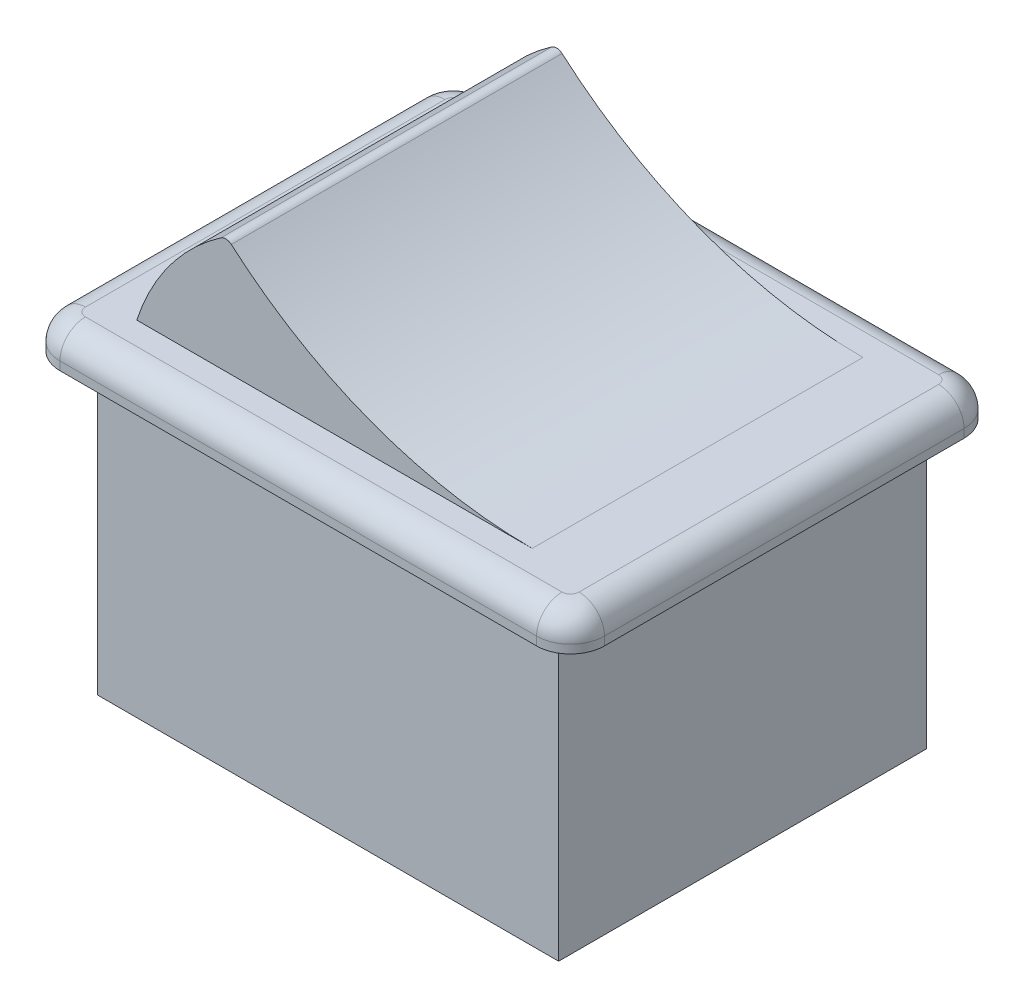
ISO-10303-21;
HEADER;
FILE_DESCRIPTION(('STEP AP214'),'2;1');
FILE_NAME('part.step','',(''),(''),'','','');
FILE_SCHEMA(('AUTOMOTIVE_DESIGN { 1 0 10303 214 1 1 1 1 }'));
ENDSEC;
DATA;
#1=APPLICATION_CONTEXT('core data for automotive mechanical design processes');
#2=APPLICATION_PROTOCOL_DEFINITION('international standard','automotive_design',2000,#1);
#3=PRODUCT_CONTEXT('',#1,'mechanical');
#4=PRODUCT('Part','Part','',(#3));
#5=PRODUCT_RELATED_PRODUCT_CATEGORY('part','',(#4));
#6=PRODUCT_DEFINITION_FORMATION('','',#4);
#7=PRODUCT_DEFINITION_CONTEXT('part definition',#1,'design');
#8=PRODUCT_DEFINITION('design','',#6,#7);
#9=PRODUCT_DEFINITION_SHAPE('','',#8);
#10=(LENGTH_UNIT() NAMED_UNIT(*) SI_UNIT(.MILLI.,.METRE.));
#11=(NAMED_UNIT(*) PLANE_ANGLE_UNIT() SI_UNIT($,.RADIAN.));
#12=(NAMED_UNIT(*) SI_UNIT($,.STERADIAN.) SOLID_ANGLE_UNIT());
#13=UNCERTAINTY_MEASURE_WITH_UNIT(LENGTH_MEASURE(1.E-05),#10,'distance_accuracy_value','');
#14=(GEOMETRIC_REPRESENTATION_CONTEXT(3) GLOBAL_UNCERTAINTY_ASSIGNED_CONTEXT((#13)) GLOBAL_UNIT_ASSIGNED_CONTEXT((#10,
#11,#12)) REPRESENTATION_CONTEXT('',''));
#15=CARTESIAN_POINT('',(0.,0.,0.));
#16=DIRECTION('',(0.,0.,1.));
#17=DIRECTION('',(1.,0.,0.));
#18=AXIS2_PLACEMENT_3D('',#15,#16,#17);
#19=CARTESIAN_POINT('',(14.05,2.,-10.6));
#20=DIRECTION('',(0.,-1.,0.));
#21=DIRECTION('',(0.,0.,-1.));
#22=AXIS2_PLACEMENT_3D('',#19,#20,#21);
#23=CYLINDRICAL_SURFACE('',#22,2.);
#24=DIRECTION('',(0.,-1.,0.));
#25=VECTOR('',#24,1.);
#26=CARTESIAN_POINT('',(14.05,2.,-12.6));
#27=LINE('',#26,#25);
#28=CARTESIAN_POINT('',(14.05,0.5,-12.6));
#29=VERTEX_POINT('',#28);
#30=CARTESIAN_POINT('',(14.05,0.,-12.6));
#31=VERTEX_POINT('',#30);
#32=EDGE_CURVE('E264',#29,#31,#27,.T.);
#33=ORIENTED_EDGE('',*,*,#32,.F.);
#34=CARTESIAN_POINT('',(14.05,0.5,-10.6));
#35=DIRECTION('',(0.,-1.,0.));
#36=DIRECTION('',(0.,0.,-1.));
#37=AXIS2_PLACEMENT_3D('',#34,#35,#36);
#38=CIRCLE('',#37,2.);
#39=CARTESIAN_POINT('',(16.05,0.5,-10.6));
#40=VERTEX_POINT('',#39);
#41=EDGE_CURVE('E11',#29,#40,#38,.T.);
#42=ORIENTED_EDGE('',*,*,#41,.T.);
#43=DIRECTION('',(0.,-1.,0.));
#44=VECTOR('',#43,1.);
#45=CARTESIAN_POINT('',(16.05,2.,-10.6));
#46=LINE('',#45,#44);
#47=CARTESIAN_POINT('',(16.05,0.,-10.6));
#48=VERTEX_POINT('',#47);
#49=EDGE_CURVE('E250',#40,#48,#46,.T.);
#50=ORIENTED_EDGE('',*,*,#49,.T.);
#51=CARTESIAN_POINT('',(14.05,0.,-10.6));
#52=DIRECTION('',(0.,1.,0.));
#53=DIRECTION('',(0.,0.,-1.));
#54=AXIS2_PLACEMENT_3D('',#51,#52,#53);
#55=CIRCLE('',#54,2.);
#56=EDGE_CURVE('E226',#48,#31,#55,.T.);
#57=ORIENTED_EDGE('',*,*,#56,.T.);
#58=EDGE_LOOP('',(#33,#42,#50,#57));
#59=FACE_BOUND('',#58,.T.);
#60=ADVANCED_FACE('F33',(#59),#23,.T.);
#61=CARTESIAN_POINT('',(-14.05,2.,-12.6));
#62=DIRECTION('',(0.,0.,1.));
#63=DIRECTION('',(1.,0.,0.));
#64=AXIS2_PLACEMENT_3D('',#61,#62,#63);
#65=PLANE('',#64);
#66=DIRECTION('',(0.,-1.,0.));
#67=VECTOR('',#66,1.);
#68=CARTESIAN_POINT('',(-14.05,2.,-12.6));
#69=LINE('',#68,#67);
#70=CARTESIAN_POINT('',(-14.05,0.5,-12.6));
#71=VERTEX_POINT('',#70);
#72=CARTESIAN_POINT('',(-14.05,0.,-12.6));
#73=VERTEX_POINT('',#72);
#74=EDGE_CURVE('E262',#71,#73,#69,.T.);
#75=ORIENTED_EDGE('',*,*,#74,.F.);
#76=DIRECTION('',(-1.,0.,0.));
#77=VECTOR('',#76,1.);
#78=CARTESIAN_POINT('',(-14.05,0.5,-12.6));
#79=LINE('',#78,#77);
#80=EDGE_CURVE('E42',#71,#29,#79,.F.);
#81=ORIENTED_EDGE('',*,*,#80,.T.);
#82=ORIENTED_EDGE('',*,*,#32,.T.);
#83=DIRECTION('',(-1.,0.,0.));
#84=VECTOR('',#83,1.);
#85=CARTESIAN_POINT('',(-14.05,0.,-12.6));
#86=LINE('',#85,#84);
#87=EDGE_CURVE('E229',#31,#73,#86,.T.);
#88=ORIENTED_EDGE('',*,*,#87,.T.);
#89=EDGE_LOOP('',(#75,#81,#82,#88));
#90=FACE_BOUND('',#89,.T.);
#91=ADVANCED_FACE('F372',(#90),#65,.F.);
#92=CARTESIAN_POINT('',(-14.05,2.,-10.6));
#93=DIRECTION('',(0.,-1.,0.));
#94=DIRECTION('',(0.,0.,-1.));
#95=AXIS2_PLACEMENT_3D('',#92,#93,#94);
#96=CYLINDRICAL_SURFACE('',#95,2.);
#97=DIRECTION('',(0.,-1.,0.));
#98=VECTOR('',#97,1.);
#99=CARTESIAN_POINT('',(-16.05,2.,-10.6));
#100=LINE('',#99,#98);
#101=CARTESIAN_POINT('',(-16.05,0.5,-10.6));
#102=VERTEX_POINT('',#101);
#103=CARTESIAN_POINT('',(-16.05,0.,-10.6));
#104=VERTEX_POINT('',#103);
#105=EDGE_CURVE('E260',#102,#104,#100,.T.);
#106=ORIENTED_EDGE('',*,*,#105,.F.);
#107=CARTESIAN_POINT('',(-14.05,0.5,-10.6));
#108=DIRECTION('',(0.,-1.,0.));
#109=DIRECTION('',(0.,0.,-1.));
#110=AXIS2_PLACEMENT_3D('',#107,#108,#109);
#111=CIRCLE('',#110,2.);
#112=EDGE_CURVE('E294',#102,#71,#111,.T.);
#113=ORIENTED_EDGE('',*,*,#112,.T.);
#114=ORIENTED_EDGE('',*,*,#74,.T.);
#115=CARTESIAN_POINT('',(-14.05,0.,-10.6));
#116=DIRECTION('',(0.,1.,0.));
#117=DIRECTION('',(0.,0.,1.));
#118=AXIS2_PLACEMENT_3D('',#115,#116,#117);
#119=CIRCLE('',#118,2.);
#120=EDGE_CURVE('E232',#73,#104,#119,.T.);
#121=ORIENTED_EDGE('',*,*,#120,.T.);
#122=EDGE_LOOP('',(#106,#113,#114,#121));
#123=FACE_BOUND('',#122,.T.);
#124=ADVANCED_FACE('F332',(#123),#96,.T.);
#125=CARTESIAN_POINT('',(-16.05,2.,-10.6));
#126=DIRECTION('',(1.,0.,0.));
#127=DIRECTION('',(0.,0.,-1.));
#128=AXIS2_PLACEMENT_3D('',#125,#126,#127);
#129=PLANE('',#128);
#130=DIRECTION('',(0.,-1.,0.));
#131=VECTOR('',#130,1.);
#132=CARTESIAN_POINT('',(-16.05,2.,10.6));
#133=LINE('',#132,#131);
#134=CARTESIAN_POINT('',(-16.05,0.5,10.6));
#135=VERTEX_POINT('',#134);
#136=CARTESIAN_POINT('',(-16.05,0.,10.6));
#137=VERTEX_POINT('',#136);
#138=EDGE_CURVE('E258',#135,#137,#133,.T.);
#139=ORIENTED_EDGE('',*,*,#138,.F.);
#140=DIRECTION('',(0.,0.,1.));
#141=VECTOR('',#140,1.);
#142=CARTESIAN_POINT('',(-16.05,0.5,-10.6));
#143=LINE('',#142,#141);
#144=EDGE_CURVE('E292',#135,#102,#143,.F.);
#145=ORIENTED_EDGE('',*,*,#144,.T.);
#146=ORIENTED_EDGE('',*,*,#105,.T.);
#147=DIRECTION('',(0.,0.,1.));
#148=VECTOR('',#147,1.);
#149=CARTESIAN_POINT('',(-16.05,0.,-10.6));
#150=LINE('',#149,#148);
#151=EDGE_CURVE('E235',#104,#137,#150,.T.);
#152=ORIENTED_EDGE('',*,*,#151,.T.);
#153=EDGE_LOOP('',(#139,#145,#146,#152));
#154=FACE_BOUND('',#153,.T.);
#155=ADVANCED_FACE('F330',(#154),#129,.F.);
#156=CARTESIAN_POINT('',(-14.05,2.,10.6));
#157=DIRECTION('',(0.,-1.,0.));
#158=DIRECTION('',(0.,0.,-1.));
#159=AXIS2_PLACEMENT_3D('',#156,#157,#158);
#160=CYLINDRICAL_SURFACE('',#159,2.);
#161=DIRECTION('',(0.,-1.,0.));
#162=VECTOR('',#161,1.);
#163=CARTESIAN_POINT('',(-14.05,2.,12.6));
#164=LINE('',#163,#162);
#165=CARTESIAN_POINT('',(-14.05,0.5,12.6));
#166=VERTEX_POINT('',#165);
#167=CARTESIAN_POINT('',(-14.05,0.,12.6));
#168=VERTEX_POINT('',#167);
#169=EDGE_CURVE('E256',#166,#168,#164,.T.);
#170=ORIENTED_EDGE('',*,*,#169,.F.);
#171=CARTESIAN_POINT('',(-14.05,0.5,10.6));
#172=DIRECTION('',(0.,-1.,0.));
#173=DIRECTION('',(0.,0.,-1.));
#174=AXIS2_PLACEMENT_3D('',#171,#172,#173);
#175=CIRCLE('',#174,2.);
#176=EDGE_CURVE('E290',#166,#135,#175,.T.);
#177=ORIENTED_EDGE('',*,*,#176,.T.);
#178=ORIENTED_EDGE('',*,*,#138,.T.);
#179=CARTESIAN_POINT('',(-14.05,0.,10.6));
#180=DIRECTION('',(0.,1.,0.));
#181=DIRECTION('',(0.,0.,1.));
#182=AXIS2_PLACEMENT_3D('',#179,#180,#181);
#183=CIRCLE('',#182,2.);
#184=EDGE_CURVE('E238',#137,#168,#183,.T.);
#185=ORIENTED_EDGE('',*,*,#184,.T.);
#186=EDGE_LOOP('',(#170,#177,#178,#185));
#187=FACE_BOUND('',#186,.T.);
#188=ADVANCED_FACE('F345',(#187),#160,.T.);
#189=CARTESIAN_POINT('',(-14.05,2.,12.6));
#190=DIRECTION('',(0.,0.,-1.));
#191=DIRECTION('',(-1.,0.,0.));
#192=AXIS2_PLACEMENT_3D('',#189,#190,#191);
#193=PLANE('',#192);
#194=DIRECTION('',(0.,-1.,0.));
#195=VECTOR('',#194,1.);
#196=CARTESIAN_POINT('',(14.05,2.,12.6));
#197=LINE('',#196,#195);
#198=CARTESIAN_POINT('',(14.05,0.5,12.6));
#199=VERTEX_POINT('',#198);
#200=CARTESIAN_POINT('',(14.05,0.,12.6));
#201=VERTEX_POINT('',#200);
#202=EDGE_CURVE('E254',#199,#201,#197,.T.);
#203=ORIENTED_EDGE('',*,*,#202,.F.);
#204=DIRECTION('',(1.,0.,0.));
#205=VECTOR('',#204,1.);
#206=CARTESIAN_POINT('',(-14.05,0.5,12.6));
#207=LINE('',#206,#205);
#208=EDGE_CURVE('E288',#199,#166,#207,.F.);
#209=ORIENTED_EDGE('',*,*,#208,.T.);
#210=ORIENTED_EDGE('',*,*,#169,.T.);
#211=DIRECTION('',(1.,0.,0.));
#212=VECTOR('',#211,1.);
#213=CARTESIAN_POINT('',(-14.05,0.,12.6));
#214=LINE('',#213,#212);
#215=EDGE_CURVE('E241',#168,#201,#214,.T.);
#216=ORIENTED_EDGE('',*,*,#215,.T.);
#217=EDGE_LOOP('',(#203,#209,#210,#216));
#218=FACE_BOUND('',#217,.T.);
#219=ADVANCED_FACE('F348',(#218),#193,.F.);
#220=CARTESIAN_POINT('',(14.05,2.,10.6));
#221=DIRECTION('',(0.,-1.,0.));
#222=DIRECTION('',(0.,0.,-1.));
#223=AXIS2_PLACEMENT_3D('',#220,#221,#222);
#224=CYLINDRICAL_SURFACE('',#223,2.);
#225=DIRECTION('',(0.,-1.,0.));
#226=VECTOR('',#225,1.);
#227=CARTESIAN_POINT('',(16.05,2.,10.6));
#228=LINE('',#227,#226);
#229=CARTESIAN_POINT('',(16.05,0.5,10.6));
#230=VERTEX_POINT('',#229);
#231=CARTESIAN_POINT('',(16.05,0.,10.6));
#232=VERTEX_POINT('',#231);
#233=EDGE_CURVE('E252',#230,#232,#228,.T.);
#234=ORIENTED_EDGE('',*,*,#233,.F.);
#235=CARTESIAN_POINT('',(14.05,0.5,10.6));
#236=DIRECTION('',(0.,-1.,0.));
#237=DIRECTION('',(0.,0.,-1.));
#238=AXIS2_PLACEMENT_3D('',#235,#236,#237);
#239=CIRCLE('',#238,2.);
#240=EDGE_CURVE('E286',#230,#199,#239,.T.);
#241=ORIENTED_EDGE('',*,*,#240,.T.);
#242=ORIENTED_EDGE('',*,*,#202,.T.);
#243=CARTESIAN_POINT('',(14.05,0.,10.6));
#244=DIRECTION('',(0.,1.,0.));
#245=DIRECTION('',(0.,0.,1.));
#246=AXIS2_PLACEMENT_3D('',#243,#244,#245);
#247=CIRCLE('',#246,2.);
#248=EDGE_CURVE('E244',#201,#232,#247,.T.);
#249=ORIENTED_EDGE('',*,*,#248,.T.);
#250=EDGE_LOOP('',(#234,#241,#242,#249));
#251=FACE_BOUND('',#250,.T.);
#252=ADVANCED_FACE('F381',(#251),#224,.T.);
#253=CARTESIAN_POINT('',(16.05,2.,-10.6));
#254=DIRECTION('',(-1.,0.,0.));
#255=DIRECTION('',(0.,0.,1.));
#256=AXIS2_PLACEMENT_3D('',#253,#254,#255);
#257=PLANE('',#256);
#258=ORIENTED_EDGE('',*,*,#49,.F.);
#259=DIRECTION('',(0.,0.,-1.));
#260=VECTOR('',#259,1.);
#261=CARTESIAN_POINT('',(16.05,0.5,-10.6));
#262=LINE('',#261,#260);
#263=EDGE_CURVE('E283',#40,#230,#262,.F.);
#264=ORIENTED_EDGE('',*,*,#263,.T.);
#265=ORIENTED_EDGE('',*,*,#233,.T.);
#266=DIRECTION('',(0.,0.,-1.));
#267=VECTOR('',#266,1.);
#268=CARTESIAN_POINT('',(16.05,0.,-10.6));
#269=LINE('',#268,#267);
#270=EDGE_CURVE('E247',#232,#48,#269,.T.);
#271=ORIENTED_EDGE('',*,*,#270,.T.);
#272=EDGE_LOOP('',(#258,#264,#265,#271));
#273=FACE_BOUND('',#272,.T.);
#274=ADVANCED_FACE('F377',(#273),#257,.F.);
#275=CARTESIAN_POINT('',(14.05,2.,-10.6));
#276=DIRECTION('',(0.,-1.,0.));
#277=DIRECTION('',(0.,0.,-1.));
#278=AXIS2_PLACEMENT_3D('',#275,#276,#277);
#279=PLANE('',#278);
#280=DIRECTION('',(0.,0.,-1.));
#281=VECTOR('',#280,1.);
#282=CARTESIAN_POINT('',(10.9429889234649,2.,9.75));
#283=LINE('',#282,#281);
#284=CARTESIAN_POINT('',(10.9429889234649,2.,9.75));
#285=VERTEX_POINT('',#284);
#286=CARTESIAN_POINT('',(10.9429889234649,2.,-9.75));
#287=VERTEX_POINT('',#286);
#288=EDGE_CURVE('E220',#285,#287,#283,.T.);
#289=ORIENTED_EDGE('',*,*,#288,.F.);
#290=DIRECTION('',(1.,0.,0.));
#291=VECTOR('',#290,1.);
#292=CARTESIAN_POINT('',(-12.369316876853,2.,9.75));
#293=LINE('',#292,#291);
#294=CARTESIAN_POINT('',(-12.369316876853,2.,9.75));
#295=VERTEX_POINT('',#294);
#296=EDGE_CURVE('E58',#295,#285,#293,.T.);
#297=ORIENTED_EDGE('',*,*,#296,.F.);
#298=DIRECTION('',(0.,0.,-1.));
#299=VECTOR('',#298,1.);
#300=CARTESIAN_POINT('',(-12.369316876853,2.,9.75));
#301=LINE('',#300,#299);
#302=CARTESIAN_POINT('',(-12.369316876853,2.,-9.75));
#303=VERTEX_POINT('',#302);
#304=EDGE_CURVE('E223',#295,#303,#301,.T.);
#305=ORIENTED_EDGE('',*,*,#304,.T.);
#306=DIRECTION('',(1.,0.,0.));
#307=VECTOR('',#306,1.);
#308=CARTESIAN_POINT('',(-12.369316876853,2.,-9.75));
#309=LINE('',#308,#307);
#310=EDGE_CURVE('E196',#303,#287,#309,.T.);
#311=ORIENTED_EDGE('',*,*,#310,.T.);
#312=EDGE_LOOP('',(#289,#297,#305,#311));
#313=FACE_BOUND('',#312,.T.);
#314=CARTESIAN_POINT('',(14.05,2.,10.6));
#315=DIRECTION('',(0.,-1.,0.));
#316=DIRECTION('',(0.,0.,-1.));
#317=AXIS2_PLACEMENT_3D('',#314,#315,#316);
#318=CIRCLE('',#317,0.5);
#319=CARTESIAN_POINT('',(14.05,2.,11.1));
#320=VERTEX_POINT('',#319);
#321=CARTESIAN_POINT('',(14.55,2.,10.6));
#322=VERTEX_POINT('',#321);
#323=EDGE_CURVE('E278',#320,#322,#318,.F.);
#324=ORIENTED_EDGE('',*,*,#323,.T.);
#325=DIRECTION('',(0.,0.,-1.));
#326=VECTOR('',#325,1.);
#327=CARTESIAN_POINT('',(14.55,2.,-10.6));
#328=LINE('',#327,#326);
#329=CARTESIAN_POINT('',(14.55,2.,-10.6));
#330=VERTEX_POINT('',#329);
#331=EDGE_CURVE('E280',#322,#330,#328,.T.);
#332=ORIENTED_EDGE('',*,*,#331,.T.);
#333=CARTESIAN_POINT('',(14.05,2.,-10.6));
#334=DIRECTION('',(0.,-1.,0.));
#335=DIRECTION('',(0.,0.,-1.));
#336=AXIS2_PLACEMENT_3D('',#333,#334,#335);
#337=CIRCLE('',#336,0.5);
#338=CARTESIAN_POINT('',(14.05,2.,-11.1));
#339=VERTEX_POINT('',#338);
#340=EDGE_CURVE('E266',#330,#339,#337,.F.);
#341=ORIENTED_EDGE('',*,*,#340,.T.);
#342=DIRECTION('',(-1.,0.,0.));
#343=VECTOR('',#342,1.);
#344=CARTESIAN_POINT('',(14.05,2.,-11.1));
#345=LINE('',#344,#343);
#346=CARTESIAN_POINT('',(-14.05,2.,-11.1));
#347=VERTEX_POINT('',#346);
#348=EDGE_CURVE('E268',#339,#347,#345,.T.);
#349=ORIENTED_EDGE('',*,*,#348,.T.);
#350=CARTESIAN_POINT('',(-14.05,2.,-10.6));
#351=DIRECTION('',(0.,-1.,0.));
#352=DIRECTION('',(0.,0.,-1.));
#353=AXIS2_PLACEMENT_3D('',#350,#351,#352);
#354=CIRCLE('',#353,0.5);
#355=CARTESIAN_POINT('',(-14.55,2.,-10.6));
#356=VERTEX_POINT('',#355);
#357=EDGE_CURVE('E270',#347,#356,#354,.F.);
#358=ORIENTED_EDGE('',*,*,#357,.T.);
#359=DIRECTION('',(0.,0.,1.));
#360=VECTOR('',#359,1.);
#361=CARTESIAN_POINT('',(-14.55,2.,-10.6));
#362=LINE('',#361,#360);
#363=CARTESIAN_POINT('',(-14.55,2.,10.6));
#364=VERTEX_POINT('',#363);
#365=EDGE_CURVE('E272',#356,#364,#362,.T.);
#366=ORIENTED_EDGE('',*,*,#365,.T.);
#367=CARTESIAN_POINT('',(-14.05,2.,10.6));
#368=DIRECTION('',(0.,-1.,0.));
#369=DIRECTION('',(0.,0.,-1.));
#370=AXIS2_PLACEMENT_3D('',#367,#368,#369);
#371=CIRCLE('',#370,0.5);
#372=CARTESIAN_POINT('',(-14.05,2.,11.1));
#373=VERTEX_POINT('',#372);
#374=EDGE_CURVE('E274',#364,#373,#371,.F.);
#375=ORIENTED_EDGE('',*,*,#374,.T.);
#376=DIRECTION('',(1.,0.,0.));
#377=VECTOR('',#376,1.);
#378=CARTESIAN_POINT('',(14.05,2.,11.1));
#379=LINE('',#378,#377);
#380=EDGE_CURVE('E276',#373,#320,#379,.T.);
#381=ORIENTED_EDGE('',*,*,#380,.T.);
#382=EDGE_LOOP('',(#324,#332,#341,#349,#358,#366,#375,#381));
#383=FACE_BOUND('',#382,.T.);
#384=ADVANCED_FACE('F361',(#313,#383),#279,.F.);
#385=CARTESIAN_POINT('',(14.05,0.,-10.6));
#386=DIRECTION('',(0.,-1.,0.));
#387=DIRECTION('',(0.,0.,-1.));
#388=AXIS2_PLACEMENT_3D('',#385,#386,#387);
#389=PLANE('',#388);
#390=DIRECTION('',(-1.,0.,0.));
#391=VECTOR('',#390,1.);
#392=CARTESIAN_POINT('',(-13.6,0.,10.85));
#393=LINE('',#392,#391);
#394=CARTESIAN_POINT('',(13.6,0.,10.85));
#395=VERTEX_POINT('',#394);
#396=CARTESIAN_POINT('',(-13.6,0.,10.85));
#397=VERTEX_POINT('',#396);
#398=EDGE_CURVE('E187',#395,#397,#393,.T.);
#399=ORIENTED_EDGE('',*,*,#398,.F.);
#400=DIRECTION('',(0.,0.,-1.));
#401=VECTOR('',#400,1.);
#402=CARTESIAN_POINT('',(13.6,0.,10.85));
#403=LINE('',#402,#401);
#404=CARTESIAN_POINT('',(13.6,0.,-10.85));
#405=VERTEX_POINT('',#404);
#406=EDGE_CURVE('E198',#395,#405,#403,.T.);
#407=ORIENTED_EDGE('',*,*,#406,.T.);
#408=DIRECTION('',(-1.,0.,0.));
#409=VECTOR('',#408,1.);
#410=CARTESIAN_POINT('',(-13.6,0.,-10.85));
#411=LINE('',#410,#409);
#412=CARTESIAN_POINT('',(-13.6,0.,-10.85));
#413=VERTEX_POINT('',#412);
#414=EDGE_CURVE('E190',#405,#413,#411,.T.);
#415=ORIENTED_EDGE('',*,*,#414,.T.);
#416=DIRECTION('',(0.,0.,-1.));
#417=VECTOR('',#416,1.);
#418=CARTESIAN_POINT('',(-13.6,0.,10.85));
#419=LINE('',#418,#417);
#420=EDGE_CURVE('E630',#397,#413,#419,.T.);
#421=ORIENTED_EDGE('',*,*,#420,.F.);
#422=EDGE_LOOP('',(#399,#407,#415,#421));
#423=FACE_BOUND('',#422,.T.);
#424=ORIENTED_EDGE('',*,*,#56,.F.);
#425=ORIENTED_EDGE('',*,*,#270,.F.);
#426=ORIENTED_EDGE('',*,*,#248,.F.);
#427=ORIENTED_EDGE('',*,*,#215,.F.);
#428=ORIENTED_EDGE('',*,*,#184,.F.);
#429=ORIENTED_EDGE('',*,*,#151,.F.);
#430=ORIENTED_EDGE('',*,*,#120,.F.);
#431=ORIENTED_EDGE('',*,*,#87,.F.);
#432=EDGE_LOOP('',(#424,#425,#426,#427,#428,#429,#430,#431));
#433=FACE_BOUND('',#432,.T.);
#434=ADVANCED_FACE('F340',(#423,#433),#389,.T.);
#435=CARTESIAN_POINT('',(-14.55,0.5,-10.6));
#436=DIRECTION('',(0.,0.,1.));
#437=DIRECTION('',(1.,0.,0.));
#438=AXIS2_PLACEMENT_3D('',#435,#436,#437);
#439=CYLINDRICAL_SURFACE('',#438,1.5);
#440=CARTESIAN_POINT('',(-14.55,0.5,-10.6));
#441=DIRECTION('',(0.,0.,-1.));
#442=DIRECTION('',(-1.,0.,0.));
#443=AXIS2_PLACEMENT_3D('',#440,#441,#442);
#444=CIRCLE('',#443,1.5);
#445=EDGE_CURVE('E311',#102,#356,#444,.T.);
#446=ORIENTED_EDGE('',*,*,#445,.F.);
#447=ORIENTED_EDGE('',*,*,#144,.F.);
#448=CARTESIAN_POINT('',(-14.55,0.5,10.6));
#449=DIRECTION('',(0.,0.,1.));
#450=DIRECTION('',(1.,0.,0.));
#451=AXIS2_PLACEMENT_3D('',#448,#449,#450);
#452=CIRCLE('',#451,1.5);
#453=EDGE_CURVE('E37',#364,#135,#452,.T.);
#454=ORIENTED_EDGE('',*,*,#453,.F.);
#455=ORIENTED_EDGE('',*,*,#365,.F.);
#456=EDGE_LOOP('',(#446,#447,#454,#455));
#457=FACE_BOUND('',#456,.T.);
#458=ADVANCED_FACE('F35',(#457),#439,.T.);
#459=CARTESIAN_POINT('',(-14.05,0.5,10.6));
#460=DIRECTION('',(0.,-1.,0.));
#461=DIRECTION('',(0.,0.,-1.));
#462=AXIS2_PLACEMENT_3D('',#459,#460,#461);
#463=DEGENERATE_TOROIDAL_SURFACE('',#462,0.5,1.5,.T.);
#464=ORIENTED_EDGE('',*,*,#453,.T.);
#465=ORIENTED_EDGE('',*,*,#176,.F.);
#466=CARTESIAN_POINT('',(-14.05,0.5,11.1));
#467=DIRECTION('',(1.,0.,0.));
#468=DIRECTION('',(0.,0.,-1.));
#469=AXIS2_PLACEMENT_3D('',#466,#467,#468);
#470=CIRCLE('',#469,1.5);
#471=EDGE_CURVE('E309',#373,#166,#470,.T.);
#472=ORIENTED_EDGE('',*,*,#471,.F.);
#473=ORIENTED_EDGE('',*,*,#374,.F.);
#474=EDGE_LOOP('',(#464,#465,#472,#473));
#475=FACE_BOUND('',#474,.T.);
#476=ADVANCED_FACE('F322',(#475),#463,.T.);
#477=CARTESIAN_POINT('',(-14.05,0.5,-10.6));
#478=DIRECTION('',(0.,-1.,0.));
#479=DIRECTION('',(0.,0.,-1.));
#480=AXIS2_PLACEMENT_3D('',#477,#478,#479);
#481=DEGENERATE_TOROIDAL_SURFACE('',#480,0.5,1.5,.T.);
#482=ORIENTED_EDGE('',*,*,#445,.T.);
#483=ORIENTED_EDGE('',*,*,#357,.F.);
#484=CARTESIAN_POINT('',(-14.05,0.5,-11.1));
#485=DIRECTION('',(1.,0.,0.));
#486=DIRECTION('',(0.,0.,-1.));
#487=AXIS2_PLACEMENT_3D('',#484,#485,#486);
#488=CIRCLE('',#487,1.5);
#489=EDGE_CURVE('E306',#71,#347,#488,.T.);
#490=ORIENTED_EDGE('',*,*,#489,.F.);
#491=ORIENTED_EDGE('',*,*,#112,.F.);
#492=EDGE_LOOP('',(#482,#483,#490,#491));
#493=FACE_BOUND('',#492,.T.);
#494=ADVANCED_FACE('F364',(#493),#481,.T.);
#495=CARTESIAN_POINT('',(14.05,0.5,11.1));
#496=DIRECTION('',(1.,0.,0.));
#497=DIRECTION('',(0.,0.,-1.));
#498=AXIS2_PLACEMENT_3D('',#495,#496,#497);
#499=CYLINDRICAL_SURFACE('',#498,1.5);
#500=ORIENTED_EDGE('',*,*,#471,.T.);
#501=ORIENTED_EDGE('',*,*,#208,.F.);
#502=CARTESIAN_POINT('',(14.05,0.5,11.1));
#503=DIRECTION('',(1.,0.,0.));
#504=DIRECTION('',(0.,0.,-1.));
#505=AXIS2_PLACEMENT_3D('',#502,#503,#504);
#506=CIRCLE('',#505,1.5);
#507=EDGE_CURVE('E303',#320,#199,#506,.T.);
#508=ORIENTED_EDGE('',*,*,#507,.F.);
#509=ORIENTED_EDGE('',*,*,#380,.F.);
#510=EDGE_LOOP('',(#500,#501,#508,#509));
#511=FACE_BOUND('',#510,.T.);
#512=ADVANCED_FACE('F352',(#511),#499,.T.);
#513=CARTESIAN_POINT('',(14.05,0.5,-11.1));
#514=DIRECTION('',(-1.,0.,0.));
#515=DIRECTION('',(0.,0.,1.));
#516=AXIS2_PLACEMENT_3D('',#513,#514,#515);
#517=CYLINDRICAL_SURFACE('',#516,1.5);
#518=ORIENTED_EDGE('',*,*,#489,.T.);
#519=ORIENTED_EDGE('',*,*,#348,.F.);
#520=CARTESIAN_POINT('',(14.05,0.5,-11.1));
#521=DIRECTION('',(1.,0.,0.));
#522=DIRECTION('',(0.,0.,-1.));
#523=AXIS2_PLACEMENT_3D('',#520,#521,#522);
#524=CIRCLE('',#523,1.5);
#525=EDGE_CURVE('E300',#29,#339,#524,.T.);
#526=ORIENTED_EDGE('',*,*,#525,.F.);
#527=ORIENTED_EDGE('',*,*,#80,.F.);
#528=EDGE_LOOP('',(#518,#519,#526,#527));
#529=FACE_BOUND('',#528,.T.);
#530=ADVANCED_FACE('F367',(#529),#517,.T.);
#531=CARTESIAN_POINT('',(14.05,0.5,10.6));
#532=DIRECTION('',(0.,-1.,0.));
#533=DIRECTION('',(0.,0.,-1.));
#534=AXIS2_PLACEMENT_3D('',#531,#532,#533);
#535=DEGENERATE_TOROIDAL_SURFACE('',#534,0.5,1.5,.T.);
#536=ORIENTED_EDGE('',*,*,#507,.T.);
#537=ORIENTED_EDGE('',*,*,#240,.F.);
#538=CARTESIAN_POINT('',(14.55,0.5,10.6));
#539=DIRECTION('',(0.,0.,-1.));
#540=DIRECTION('',(-1.,0.,0.));
#541=AXIS2_PLACEMENT_3D('',#538,#539,#540);
#542=CIRCLE('',#541,1.5);
#543=EDGE_CURVE('E298',#322,#230,#542,.T.);
#544=ORIENTED_EDGE('',*,*,#543,.F.);
#545=ORIENTED_EDGE('',*,*,#323,.F.);
#546=EDGE_LOOP('',(#536,#537,#544,#545));
#547=FACE_BOUND('',#546,.T.);
#548=ADVANCED_FACE('F357',(#547),#535,.T.);
#549=CARTESIAN_POINT('',(14.05,0.5,-10.6));
#550=DIRECTION('',(0.,-1.,0.));
#551=DIRECTION('',(0.,0.,-1.));
#552=AXIS2_PLACEMENT_3D('',#549,#550,#551);
#553=DEGENERATE_TOROIDAL_SURFACE('',#552,0.5,1.5,.T.);
#554=ORIENTED_EDGE('',*,*,#525,.T.);
#555=ORIENTED_EDGE('',*,*,#340,.F.);
#556=CARTESIAN_POINT('',(14.55,0.5,-10.6));
#557=DIRECTION('',(0.,0.,1.));
#558=DIRECTION('',(1.,0.,0.));
#559=AXIS2_PLACEMENT_3D('',#556,#557,#558);
#560=CIRCLE('',#559,1.5);
#561=EDGE_CURVE('E225',#40,#330,#560,.T.);
#562=ORIENTED_EDGE('',*,*,#561,.F.);
#563=ORIENTED_EDGE('',*,*,#41,.F.);
#564=EDGE_LOOP('',(#554,#555,#562,#563));
#565=FACE_BOUND('',#564,.T.);
#566=ADVANCED_FACE('F402',(#565),#553,.T.);
#567=CARTESIAN_POINT('',(14.55,0.5,-10.6));
#568=DIRECTION('',(0.,0.,-1.));
#569=DIRECTION('',(-1.,0.,0.));
#570=AXIS2_PLACEMENT_3D('',#567,#568,#569);
#571=CYLINDRICAL_SURFACE('',#570,1.5);
#572=ORIENTED_EDGE('',*,*,#543,.T.);
#573=ORIENTED_EDGE('',*,*,#263,.F.);
#574=ORIENTED_EDGE('',*,*,#561,.T.);
#575=ORIENTED_EDGE('',*,*,#331,.F.);
#576=EDGE_LOOP('',(#572,#573,#574,#575));
#577=FACE_BOUND('',#576,.T.);
#578=ADVANCED_FACE('F398',(#577),#571,.T.);
#579=CARTESIAN_POINT('',(0.,-2.,9.75));
#580=DIRECTION('',(0.,0.,-1.));
#581=DIRECTION('',(-1.,0.,0.));
#582=AXIS2_PLACEMENT_3D('',#579,#580,#581);
#583=CYLINDRICAL_SURFACE('',#582,13.);
#584=CARTESIAN_POINT('',(0.,-2.,-9.75));
#585=DIRECTION('',(0.,0.,1.));
#586=DIRECTION('',(1.,0.,0.));
#587=AXIS2_PLACEMENT_3D('',#584,#585,#586);
#588=CIRCLE('',#587,13.);
#589=CARTESIAN_POINT('',(-7.41141069972325,8.68040221340132,-9.75));
#590=VERTEX_POINT('',#589);
#591=EDGE_CURVE('E193',#590,#303,#588,.T.);
#592=ORIENTED_EDGE('',*,*,#591,.T.);
#593=ORIENTED_EDGE('',*,*,#304,.F.);
#594=CARTESIAN_POINT('',(0.,-2.,9.75));
#595=DIRECTION('',(0.,0.,1.));
#596=DIRECTION('',(1.,0.,0.));
#597=AXIS2_PLACEMENT_3D('',#594,#595,#596);
#598=CIRCLE('',#597,13.);
#599=CARTESIAN_POINT('',(-7.41141069972325,8.68040221340132,9.75));
#600=VERTEX_POINT('',#599);
#601=EDGE_CURVE('E202',#600,#295,#598,.T.);
#602=ORIENTED_EDGE('',*,*,#601,.F.);
#603=DIRECTION('',(0.,0.,-1.));
#604=VECTOR('',#603,1.);
#605=CARTESIAN_POINT('',(-7.41141069972325,8.68040221340132,9.75));
#606=LINE('',#605,#604);
#607=EDGE_CURVE('E209',#600,#590,#606,.T.);
#608=ORIENTED_EDGE('',*,*,#607,.T.);
#609=EDGE_LOOP('',(#592,#593,#602,#608));
#610=FACE_BOUND('',#609,.T.);
#611=ADVANCED_FACE('F401',(#610),#583,.T.);
#612=CARTESIAN_POINT('',(10.9429889234649,29.,9.75));
#613=DIRECTION('',(0.,0.,-1.));
#614=DIRECTION('',(-1.,0.,0.));
#615=AXIS2_PLACEMENT_3D('',#612,#613,#614);
#616=CYLINDRICAL_SURFACE('',#615,27.);
#617=CARTESIAN_POINT('',(10.9429889234649,29.,-9.75));
#618=DIRECTION('',(0.,0.,-1.));
#619=DIRECTION('',(1.,0.,0.));
#620=AXIS2_PLACEMENT_3D('',#617,#618,#619);
#621=CIRCLE('',#620,27.);
#622=CARTESIAN_POINT('',(-6.79782288994148,8.64653355810614,-9.75));
#623=VERTEX_POINT('',#622);
#624=EDGE_CURVE('E212',#287,#623,#621,.T.);
#625=ORIENTED_EDGE('',*,*,#624,.T.);
#626=DIRECTION('',(0.,0.,-1.));
#627=VECTOR('',#626,1.);
#628=CARTESIAN_POINT('',(-6.79782288994148,8.64653355810614,9.75));
#629=LINE('',#628,#627);
#630=CARTESIAN_POINT('',(-6.79782288994148,8.64653355810614,9.75));
#631=VERTEX_POINT('',#630);
#632=EDGE_CURVE('E217',#631,#623,#629,.T.);
#633=ORIENTED_EDGE('',*,*,#632,.F.);
#634=CARTESIAN_POINT('',(10.9429889234649,29.,9.75));
#635=DIRECTION('',(0.,0.,-1.));
#636=DIRECTION('',(1.,0.,0.));
#637=AXIS2_PLACEMENT_3D('',#634,#635,#636);
#638=CIRCLE('',#637,27.);
#639=EDGE_CURVE('E206',#285,#631,#638,.T.);
#640=ORIENTED_EDGE('',*,*,#639,.F.);
#641=ORIENTED_EDGE('',*,*,#288,.T.);
#642=EDGE_LOOP('',(#625,#633,#640,#641));
#643=FACE_BOUND('',#642,.T.);
#644=ADVANCED_FACE('F430',(#643),#616,.F.);
#645=CARTESIAN_POINT('',(-7.12635644204159,8.26961751288588,9.75));
#646=DIRECTION('',(0.,0.,-1.));
#647=DIRECTION('',(-1.,0.,0.));
#648=AXIS2_PLACEMENT_3D('',#645,#646,#647);
#649=CYLINDRICAL_SURFACE('',#648,0.499999999999999);
#650=CARTESIAN_POINT('',(-7.12635644204159,8.26961751288588,-9.75));
#651=DIRECTION('',(0.,0.,1.));
#652=DIRECTION('',(1.,0.,0.));
#653=AXIS2_PLACEMENT_3D('',#650,#651,#652);
#654=CIRCLE('',#653,0.499999999999999);
#655=EDGE_CURVE('E204',#623,#590,#654,.T.);
#656=ORIENTED_EDGE('',*,*,#655,.T.);
#657=ORIENTED_EDGE('',*,*,#607,.F.);
#658=CARTESIAN_POINT('',(-7.12635644204159,8.26961751288588,9.75));
#659=DIRECTION('',(0.,0.,1.));
#660=DIRECTION('',(1.,0.,0.));
#661=AXIS2_PLACEMENT_3D('',#658,#659,#660);
#662=CIRCLE('',#661,0.499999999999999);
#663=EDGE_CURVE('E208',#631,#600,#662,.T.);
#664=ORIENTED_EDGE('',*,*,#663,.F.);
#665=ORIENTED_EDGE('',*,*,#632,.T.);
#666=EDGE_LOOP('',(#656,#657,#664,#665));
#667=FACE_BOUND('',#666,.T.);
#668=ADVANCED_FACE('F434',(#667),#649,.T.);
#669=CARTESIAN_POINT('',(0.,-2.,9.75));
#670=DIRECTION('',(0.,0.,1.));
#671=DIRECTION('',(1.,0.,0.));
#672=AXIS2_PLACEMENT_3D('',#669,#670,#671);
#673=PLANE('',#672);
#674=ORIENTED_EDGE('',*,*,#601,.T.);
#675=ORIENTED_EDGE('',*,*,#296,.T.);
#676=ORIENTED_EDGE('',*,*,#639,.T.);
#677=ORIENTED_EDGE('',*,*,#663,.T.);
#678=EDGE_LOOP('',(#674,#675,#676,#677));
#679=FACE_BOUND('',#678,.T.);
#680=ADVANCED_FACE('F438',(#679),#673,.T.);
#681=CARTESIAN_POINT('',(0.,-2.,-9.75));
#682=DIRECTION('',(0.,0.,1.));
#683=DIRECTION('',(1.,0.,0.));
#684=AXIS2_PLACEMENT_3D('',#681,#682,#683);
#685=PLANE('',#684);
#686=ORIENTED_EDGE('',*,*,#591,.F.);
#687=ORIENTED_EDGE('',*,*,#655,.F.);
#688=ORIENTED_EDGE('',*,*,#624,.F.);
#689=ORIENTED_EDGE('',*,*,#310,.F.);
#690=EDGE_LOOP('',(#686,#687,#688,#689));
#691=FACE_BOUND('',#690,.T.);
#692=ADVANCED_FACE('F440',(#691),#685,.F.);
#693=CARTESIAN_POINT('',(-13.6,0.,10.85));
#694=DIRECTION('',(1.,0.,0.));
#695=DIRECTION('',(0.,1.,0.));
#696=AXIS2_PLACEMENT_3D('',#693,#694,#695);
#697=PLANE('',#696);
#698=DIRECTION('',(0.,-1.,0.));
#699=VECTOR('',#698,1.);
#700=CARTESIAN_POINT('',(-13.6,0.,-10.85));
#701=LINE('',#700,#699);
#702=CARTESIAN_POINT('',(-13.6,-17.2,-10.85));
#703=VERTEX_POINT('',#702);
#704=EDGE_CURVE('E50',#413,#703,#701,.T.);
#705=ORIENTED_EDGE('',*,*,#704,.T.);
#706=DIRECTION('',(0.,0.,-1.));
#707=VECTOR('',#706,1.);
#708=CARTESIAN_POINT('',(-13.6,-17.2,10.85));
#709=LINE('',#708,#707);
#710=CARTESIAN_POINT('',(-13.6,-17.2,10.85));
#711=VERTEX_POINT('',#710);
#712=EDGE_CURVE('E176',#711,#703,#709,.T.);
#713=ORIENTED_EDGE('',*,*,#712,.F.);
#714=DIRECTION('',(0.,-1.,0.));
#715=VECTOR('',#714,1.);
#716=CARTESIAN_POINT('',(-13.6,0.,10.85));
#717=LINE('',#716,#715);
#718=EDGE_CURVE('E182',#397,#711,#717,.T.);
#719=ORIENTED_EDGE('',*,*,#718,.F.);
#720=ORIENTED_EDGE('',*,*,#420,.T.);
#721=EDGE_LOOP('',(#705,#713,#719,#720));
#722=FACE_BOUND('',#721,.T.);
#723=ADVANCED_FACE('F192',(#722),#697,.F.);
#724=CARTESIAN_POINT('',(-13.6,-17.2,10.85));
#725=DIRECTION('',(0.,1.,0.));
#726=DIRECTION('',(-1.,0.,0.));
#727=AXIS2_PLACEMENT_3D('',#724,#725,#726);
#728=PLANE('',#727);
#729=DIRECTION('',(1.,0.,0.));
#730=VECTOR('',#729,1.);
#731=CARTESIAN_POINT('',(-13.6,-17.2,-10.85));
#732=LINE('',#731,#730);
#733=CARTESIAN_POINT('',(13.6,-17.2,-10.85));
#734=VERTEX_POINT('',#733);
#735=EDGE_CURVE('E626',#703,#734,#732,.T.);
#736=ORIENTED_EDGE('',*,*,#735,.T.);
#737=DIRECTION('',(0.,0.,-1.));
#738=VECTOR('',#737,1.);
#739=CARTESIAN_POINT('',(13.6,-17.2,10.85));
#740=LINE('',#739,#738);
#741=CARTESIAN_POINT('',(13.6,-17.2,10.85));
#742=VERTEX_POINT('',#741);
#743=EDGE_CURVE('E178',#742,#734,#740,.T.);
#744=ORIENTED_EDGE('',*,*,#743,.F.);
#745=DIRECTION('',(1.,0.,0.));
#746=VECTOR('',#745,1.);
#747=CARTESIAN_POINT('',(-13.6,-17.2,10.85));
#748=LINE('',#747,#746);
#749=EDGE_CURVE('E172',#711,#742,#748,.T.);
#750=ORIENTED_EDGE('',*,*,#749,.F.);
#751=ORIENTED_EDGE('',*,*,#712,.T.);
#752=EDGE_LOOP('',(#736,#744,#750,#751));
#753=FACE_BOUND('',#752,.T.);
#754=ADVANCED_FACE('F174',(#753),#728,.F.);
#755=CARTESIAN_POINT('',(13.6,0.,10.85));
#756=DIRECTION('',(-1.,0.,0.));
#757=DIRECTION('',(0.,-1.,0.));
#758=AXIS2_PLACEMENT_3D('',#755,#756,#757);
#759=PLANE('',#758);
#760=DIRECTION('',(0.,1.,0.));
#761=VECTOR('',#760,1.);
#762=CARTESIAN_POINT('',(13.6,0.,-10.85));
#763=LINE('',#762,#761);
#764=EDGE_CURVE('E624',#734,#405,#763,.T.);
#765=ORIENTED_EDGE('',*,*,#764,.T.);
#766=ORIENTED_EDGE('',*,*,#406,.F.);
#767=DIRECTION('',(0.,1.,0.));
#768=VECTOR('',#767,1.);
#769=CARTESIAN_POINT('',(13.6,0.,10.85));
#770=LINE('',#769,#768);
#771=EDGE_CURVE('E181',#742,#395,#770,.T.);
#772=ORIENTED_EDGE('',*,*,#771,.F.);
#773=ORIENTED_EDGE('',*,*,#743,.T.);
#774=EDGE_LOOP('',(#765,#766,#772,#773));
#775=FACE_BOUND('',#774,.T.);
#776=ADVANCED_FACE('F451',(#775),#759,.F.);
#777=CARTESIAN_POINT('',(-13.6,-17.2,10.85));
#778=DIRECTION('',(0.,0.,1.));
#779=DIRECTION('',(1.,0.,0.));
#780=AXIS2_PLACEMENT_3D('',#777,#778,#779);
#781=PLANE('',#780);
#782=ORIENTED_EDGE('',*,*,#718,.T.);
#783=ORIENTED_EDGE('',*,*,#749,.T.);
#784=ORIENTED_EDGE('',*,*,#771,.T.);
#785=ORIENTED_EDGE('',*,*,#398,.T.);
#786=EDGE_LOOP('',(#782,#783,#784,#785));
#787=FACE_BOUND('',#786,.T.);
#788=ADVANCED_FACE('F185',(#787),#781,.T.);
#789=CARTESIAN_POINT('',(-13.6,-17.2,-10.85));
#790=DIRECTION('',(0.,0.,1.));
#791=DIRECTION('',(1.,0.,0.));
#792=AXIS2_PLACEMENT_3D('',#789,#790,#791);
#793=PLANE('',#792);
#794=ORIENTED_EDGE('',*,*,#704,.F.);
#795=ORIENTED_EDGE('',*,*,#414,.F.);
#796=ORIENTED_EDGE('',*,*,#764,.F.);
#797=ORIENTED_EDGE('',*,*,#735,.F.);
#798=EDGE_LOOP('',(#794,#795,#796,#797));
#799=FACE_BOUND('',#798,.T.);
#800=ADVANCED_FACE('F455',(#799),#793,.F.);
#801=CLOSED_SHELL('',(#60,#91,#124,#155,#188,#219,#252,#274,#384,#434,#458,#476,#494,#512,#530,
#548,#566,#578,#611,#644,#668,#680,#692,#723,#754,#776,#788,#800));
#802=MANIFOLD_SOLID_BREP('B2',#801);
#803=ADVANCED_BREP_SHAPE_REPRESENTATION('',(#18,#802),#14);
#804=SHAPE_DEFINITION_REPRESENTATION(#9,#803);
ENDSEC;
END-ISO-10303-21;
